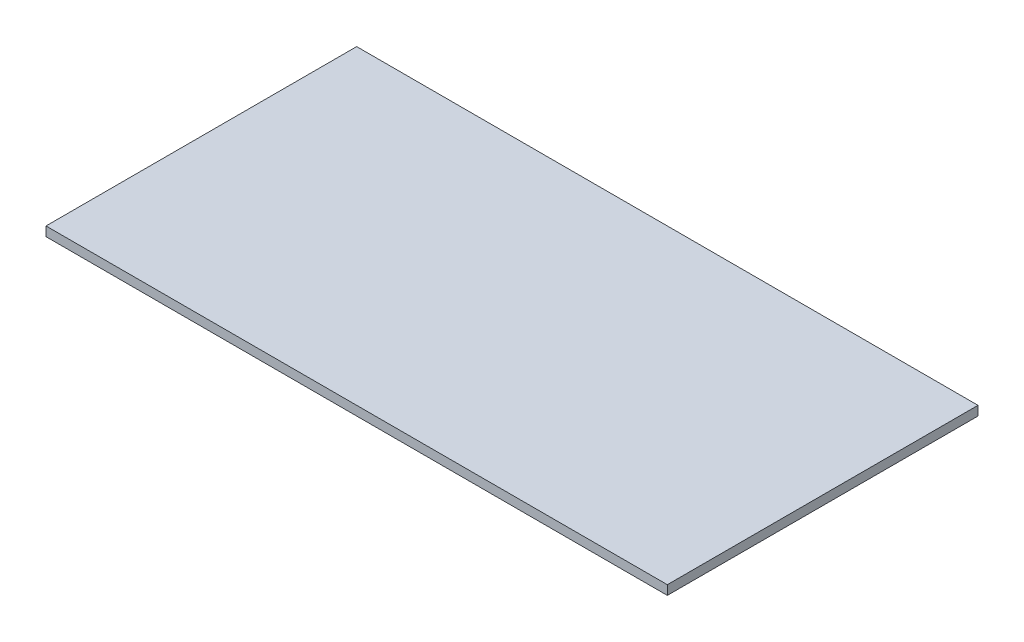
ISO-10303-21;
HEADER;
FILE_DESCRIPTION(('STEP AP214'),'2;1');
FILE_NAME('part.step','',(''),(''),'','','');
FILE_SCHEMA(('AUTOMOTIVE_DESIGN { 1 0 10303 214 1 1 1 1 }'));
ENDSEC;
DATA;
#1=APPLICATION_CONTEXT('core data for automotive mechanical design processes');
#2=APPLICATION_PROTOCOL_DEFINITION('international standard','automotive_design',2000,#1);
#3=PRODUCT_CONTEXT('',#1,'mechanical');
#4=PRODUCT('Part','Part','',(#3));
#5=PRODUCT_RELATED_PRODUCT_CATEGORY('part','',(#4));
#6=PRODUCT_DEFINITION_FORMATION('','',#4);
#7=PRODUCT_DEFINITION_CONTEXT('part definition',#1,'design');
#8=PRODUCT_DEFINITION('design','',#6,#7);
#9=PRODUCT_DEFINITION_SHAPE('','',#8);
#10=(LENGTH_UNIT() NAMED_UNIT(*) SI_UNIT(.MILLI.,.METRE.));
#11=(NAMED_UNIT(*) PLANE_ANGLE_UNIT() SI_UNIT($,.RADIAN.));
#12=(NAMED_UNIT(*) SI_UNIT($,.STERADIAN.) SOLID_ANGLE_UNIT());
#13=UNCERTAINTY_MEASURE_WITH_UNIT(LENGTH_MEASURE(1.E-05),#10,'distance_accuracy_value','');
#14=(GEOMETRIC_REPRESENTATION_CONTEXT(3) GLOBAL_UNCERTAINTY_ASSIGNED_CONTEXT((#13)) GLOBAL_UNIT_ASSIGNED_CONTEXT((#10,
#11,#12)) REPRESENTATION_CONTEXT('',''));
#15=CARTESIAN_POINT('',(0.,0.,0.));
#16=DIRECTION('',(0.,0.,1.));
#17=DIRECTION('',(1.,0.,0.));
#18=AXIS2_PLACEMENT_3D('',#15,#16,#17);
#19=CARTESIAN_POINT('',(609.6,18.25625,304.8));
#20=DIRECTION('',(-1.,0.,0.));
#21=DIRECTION('',(0.,0.,1.));
#22=AXIS2_PLACEMENT_3D('',#19,#20,#21);
#23=PLANE('',#22);
#24=DIRECTION('',(0.,0.,-1.));
#25=VECTOR('',#24,1.);
#26=CARTESIAN_POINT('',(609.6,0.,304.8));
#27=LINE('',#26,#25);
#28=CARTESIAN_POINT('',(609.6,0.,304.8));
#29=VERTEX_POINT('',#28);
#30=CARTESIAN_POINT('',(609.6,0.,-304.8));
#31=VERTEX_POINT('',#30);
#32=EDGE_CURVE('E107',#29,#31,#27,.T.);
#33=ORIENTED_EDGE('',*,*,#32,.T.);
#34=DIRECTION('',(0.,-1.,0.));
#35=VECTOR('',#34,1.);
#36=CARTESIAN_POINT('',(609.6,18.25625,-304.8));
#37=LINE('',#36,#35);
#38=CARTESIAN_POINT('',(609.6,18.25625,-304.8));
#39=VERTEX_POINT('',#38);
#40=EDGE_CURVE('E11',#39,#31,#37,.T.);
#41=ORIENTED_EDGE('',*,*,#40,.F.);
#42=DIRECTION('',(0.,0.,-1.));
#43=VECTOR('',#42,1.);
#44=CARTESIAN_POINT('',(609.6,18.25625,304.8));
#45=LINE('',#44,#43);
#46=CARTESIAN_POINT('',(609.6,18.25625,304.8));
#47=VERTEX_POINT('',#46);
#48=EDGE_CURVE('E91',#47,#39,#45,.T.);
#49=ORIENTED_EDGE('',*,*,#48,.F.);
#50=DIRECTION('',(0.,-1.,0.));
#51=VECTOR('',#50,1.);
#52=CARTESIAN_POINT('',(609.6,18.25625,304.8));
#53=LINE('',#52,#51);
#54=EDGE_CURVE('E103',#47,#29,#53,.T.);
#55=ORIENTED_EDGE('',*,*,#54,.T.);
#56=EDGE_LOOP('',(#33,#41,#49,#55));
#57=FACE_BOUND('',#56,.T.);
#58=ADVANCED_FACE('F39',(#57),#23,.F.);
#59=CARTESIAN_POINT('',(-609.6,18.25625,-304.8));
#60=DIRECTION('',(0.,0.,1.));
#61=DIRECTION('',(1.,0.,0.));
#62=AXIS2_PLACEMENT_3D('',#59,#60,#61);
#63=PLANE('',#62);
#64=DIRECTION('',(-1.,0.,0.));
#65=VECTOR('',#64,1.);
#66=CARTESIAN_POINT('',(-609.6,0.,-304.8));
#67=LINE('',#66,#65);
#68=CARTESIAN_POINT('',(-609.6,0.,-304.8));
#69=VERTEX_POINT('',#68);
#70=EDGE_CURVE('E96',#31,#69,#67,.T.);
#71=ORIENTED_EDGE('',*,*,#70,.T.);
#72=DIRECTION('',(0.,-1.,0.));
#73=VECTOR('',#72,1.);
#74=CARTESIAN_POINT('',(-609.6,18.25625,-304.8));
#75=LINE('',#74,#73);
#76=CARTESIAN_POINT('',(-609.6,18.25625,-304.8));
#77=VERTEX_POINT('',#76);
#78=EDGE_CURVE('E48',#77,#69,#75,.T.);
#79=ORIENTED_EDGE('',*,*,#78,.F.);
#80=DIRECTION('',(-1.,0.,0.));
#81=VECTOR('',#80,1.);
#82=CARTESIAN_POINT('',(-609.6,18.25625,-304.8));
#83=LINE('',#82,#81);
#84=EDGE_CURVE('E86',#39,#77,#83,.T.);
#85=ORIENTED_EDGE('',*,*,#84,.F.);
#86=ORIENTED_EDGE('',*,*,#40,.T.);
#87=EDGE_LOOP('',(#71,#79,#85,#86));
#88=FACE_BOUND('',#87,.T.);
#89=ADVANCED_FACE('F95',(#88),#63,.F.);
#90=CARTESIAN_POINT('',(-609.6,18.25625,304.8));
#91=DIRECTION('',(1.,0.,0.));
#92=DIRECTION('',(0.,0.,-1.));
#93=AXIS2_PLACEMENT_3D('',#90,#91,#92);
#94=PLANE('',#93);
#95=DIRECTION('',(0.,0.,1.));
#96=VECTOR('',#95,1.);
#97=CARTESIAN_POINT('',(-609.6,0.,304.8));
#98=LINE('',#97,#96);
#99=CARTESIAN_POINT('',(-609.6,0.,304.8));
#100=VERTEX_POINT('',#99);
#101=EDGE_CURVE('E73',#69,#100,#98,.T.);
#102=ORIENTED_EDGE('',*,*,#101,.T.);
#103=DIRECTION('',(0.,-1.,0.));
#104=VECTOR('',#103,1.);
#105=CARTESIAN_POINT('',(-609.6,18.25625,304.8));
#106=LINE('',#105,#104);
#107=CARTESIAN_POINT('',(-609.6,18.25625,304.8));
#108=VERTEX_POINT('',#107);
#109=EDGE_CURVE('E98',#108,#100,#106,.T.);
#110=ORIENTED_EDGE('',*,*,#109,.F.);
#111=DIRECTION('',(0.,0.,1.));
#112=VECTOR('',#111,1.);
#113=CARTESIAN_POINT('',(-609.6,18.25625,304.8));
#114=LINE('',#113,#112);
#115=EDGE_CURVE('E89',#77,#108,#114,.T.);
#116=ORIENTED_EDGE('',*,*,#115,.F.);
#117=ORIENTED_EDGE('',*,*,#78,.T.);
#118=EDGE_LOOP('',(#102,#110,#116,#117));
#119=FACE_BOUND('',#118,.T.);
#120=ADVANCED_FACE('F99',(#119),#94,.F.);
#121=CARTESIAN_POINT('',(-609.6,18.25625,304.8));
#122=DIRECTION('',(0.,0.,-1.));
#123=DIRECTION('',(-1.,0.,0.));
#124=AXIS2_PLACEMENT_3D('',#121,#122,#123);
#125=PLANE('',#124);
#126=DIRECTION('',(1.,0.,0.));
#127=VECTOR('',#126,1.);
#128=CARTESIAN_POINT('',(-609.6,0.,304.8));
#129=LINE('',#128,#127);
#130=EDGE_CURVE('E79',#100,#29,#129,.T.);
#131=ORIENTED_EDGE('',*,*,#130,.T.);
#132=ORIENTED_EDGE('',*,*,#54,.F.);
#133=DIRECTION('',(1.,0.,0.));
#134=VECTOR('',#133,1.);
#135=CARTESIAN_POINT('',(-609.6,18.25625,304.8));
#136=LINE('',#135,#134);
#137=EDGE_CURVE('E56',#108,#47,#136,.T.);
#138=ORIENTED_EDGE('',*,*,#137,.F.);
#139=ORIENTED_EDGE('',*,*,#109,.T.);
#140=EDGE_LOOP('',(#131,#132,#138,#139));
#141=FACE_BOUND('',#140,.T.);
#142=ADVANCED_FACE('F120',(#141),#125,.F.);
#143=CARTESIAN_POINT('',(0.,18.25625,0.));
#144=DIRECTION('',(0.,-1.,0.));
#145=DIRECTION('',(0.,0.,-1.));
#146=AXIS2_PLACEMENT_3D('',#143,#144,#145);
#147=PLANE('',#146);
#148=ORIENTED_EDGE('',*,*,#48,.T.);
#149=ORIENTED_EDGE('',*,*,#84,.T.);
#150=ORIENTED_EDGE('',*,*,#115,.T.);
#151=ORIENTED_EDGE('',*,*,#137,.T.);
#152=EDGE_LOOP('',(#148,#149,#150,#151));
#153=FACE_BOUND('',#152,.T.);
#154=ADVANCED_FACE('F87',(#153),#147,.F.);
#155=CARTESIAN_POINT('',(0.,0.,0.));
#156=DIRECTION('',(0.,-1.,0.));
#157=DIRECTION('',(0.,0.,-1.));
#158=AXIS2_PLACEMENT_3D('',#155,#156,#157);
#159=PLANE('',#158);
#160=ORIENTED_EDGE('',*,*,#32,.F.);
#161=ORIENTED_EDGE('',*,*,#130,.F.);
#162=ORIENTED_EDGE('',*,*,#101,.F.);
#163=ORIENTED_EDGE('',*,*,#70,.F.);
#164=EDGE_LOOP('',(#160,#161,#162,#163));
#165=FACE_BOUND('',#164,.T.);
#166=ADVANCED_FACE('F123',(#165),#159,.T.);
#167=CLOSED_SHELL('',(#58,#89,#120,#142,#154,#166));
#168=MANIFOLD_SOLID_BREP('B2',#167);
#169=ADVANCED_BREP_SHAPE_REPRESENTATION('',(#18,#168),#14);
#170=SHAPE_DEFINITION_REPRESENTATION(#9,#169);
ENDSEC;
END-ISO-10303-21;
